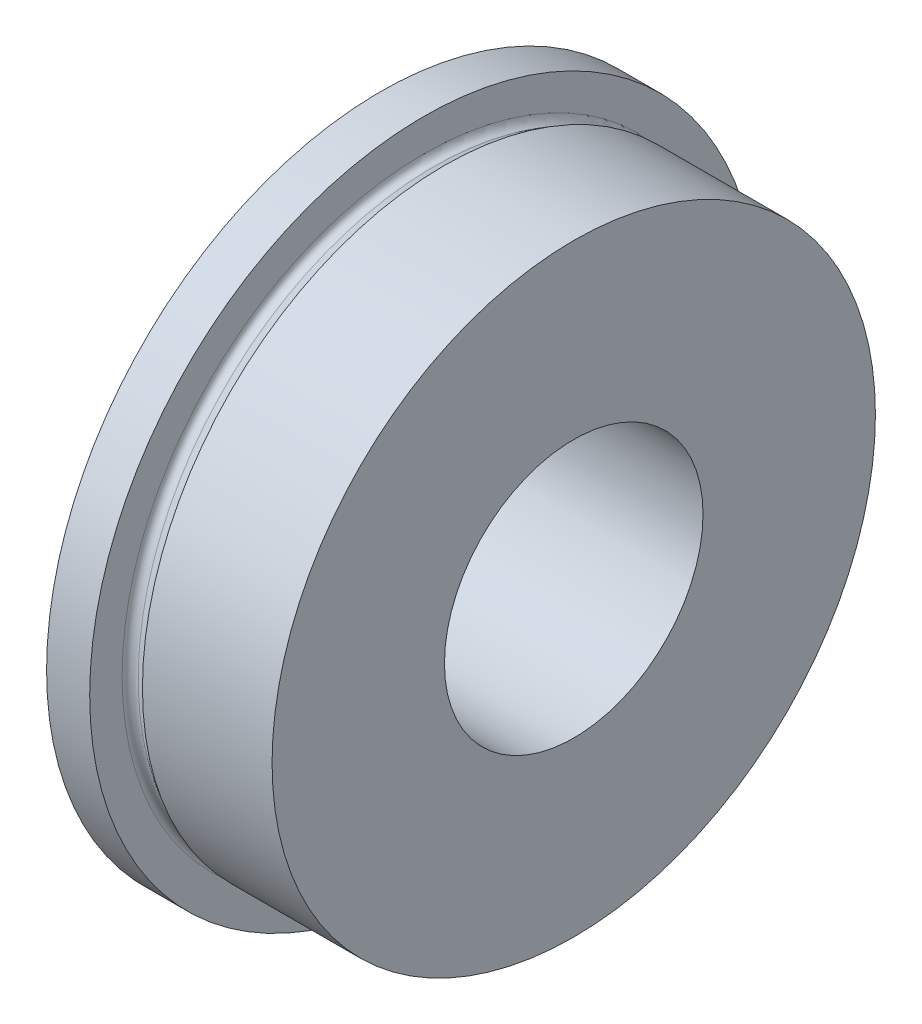
ISO-10303-21;
HEADER;
FILE_DESCRIPTION(('STEP AP214'),'2;1');
FILE_NAME('part.step','',(''),(''),'','','');
FILE_SCHEMA(('AUTOMOTIVE_DESIGN { 1 0 10303 214 1 1 1 1 }'));
ENDSEC;
DATA;
#1=APPLICATION_CONTEXT('core data for automotive mechanical design processes');
#2=APPLICATION_PROTOCOL_DEFINITION('international standard','automotive_design',2000,#1);
#3=PRODUCT_CONTEXT('',#1,'mechanical');
#4=PRODUCT('Part','Part','',(#3));
#5=PRODUCT_RELATED_PRODUCT_CATEGORY('part','',(#4));
#6=PRODUCT_DEFINITION_FORMATION('','',#4);
#7=PRODUCT_DEFINITION_CONTEXT('part definition',#1,'design');
#8=PRODUCT_DEFINITION('design','',#6,#7);
#9=PRODUCT_DEFINITION_SHAPE('','',#8);
#10=(LENGTH_UNIT() NAMED_UNIT(*) SI_UNIT(.MILLI.,.METRE.));
#11=(NAMED_UNIT(*) PLANE_ANGLE_UNIT() SI_UNIT($,.RADIAN.));
#12=(NAMED_UNIT(*) SI_UNIT($,.STERADIAN.) SOLID_ANGLE_UNIT());
#13=UNCERTAINTY_MEASURE_WITH_UNIT(LENGTH_MEASURE(1.E-05),#10,'distance_accuracy_value','');
#14=(GEOMETRIC_REPRESENTATION_CONTEXT(3) GLOBAL_UNCERTAINTY_ASSIGNED_CONTEXT((#13)) GLOBAL_UNIT_ASSIGNED_CONTEXT((#10,
#11,#12)) REPRESENTATION_CONTEXT('',''));
#15=CARTESIAN_POINT('',(0.,0.,0.));
#16=DIRECTION('',(0.,0.,1.));
#17=DIRECTION('',(1.,0.,0.));
#18=AXIS2_PLACEMENT_3D('',#15,#16,#17);
#19=CARTESIAN_POINT('',(0.,0.,0.));
#20=DIRECTION('',(-1.,0.,0.));
#21=DIRECTION('',(0.,0.,1.));
#22=AXIS2_PLACEMENT_3D('',#19,#20,#21);
#23=CYLINDRICAL_SURFACE('',#22,12.3063);
#24=CARTESIAN_POINT('',(0.,0.,0.));
#25=DIRECTION('',(-1.,0.,0.));
#26=DIRECTION('',(0.,0.,1.));
#27=AXIS2_PLACEMENT_3D('',#24,#25,#26);
#28=CIRCLE('',#27,12.3063);
#29=CARTESIAN_POINT('',(0.,0.,12.3063));
#30=VERTEX_POINT('',#29);
#31=EDGE_CURVE('E96',#30,#30,#28,.F.);
#32=ORIENTED_EDGE('',*,*,#31,.T.);
#33=EDGE_LOOP('',(#32));
#34=FACE_BOUND('',#33,.T.);
#35=CARTESIAN_POINT('',(1.5875,0.,0.));
#36=DIRECTION('',(-1.,0.,0.));
#37=DIRECTION('',(0.,0.,1.));
#38=AXIS2_PLACEMENT_3D('',#35,#36,#37);
#39=CIRCLE('',#38,12.3063);
#40=CARTESIAN_POINT('',(1.5875,0.,12.3063));
#41=VERTEX_POINT('',#40);
#42=EDGE_CURVE('E94',#41,#41,#39,.T.);
#43=ORIENTED_EDGE('',*,*,#42,.T.);
#44=EDGE_LOOP('',(#43));
#45=FACE_BOUND('',#44,.T.);
#46=ADVANCED_FACE('F17',(#34,#45),#23,.T.);
#47=CARTESIAN_POINT('',(0.,12.3063,0.));
#48=DIRECTION('',(1.,0.,0.));
#49=DIRECTION('',(0.,0.,-1.));
#50=AXIS2_PLACEMENT_3D('',#47,#48,#49);
#51=PLANE('',#50);
#52=ORIENTED_EDGE('',*,*,#31,.F.);
#53=EDGE_LOOP('',(#52));
#54=FACE_BOUND('',#53,.T.);
#55=CARTESIAN_POINT('',(0.,0.,0.));
#56=DIRECTION('',(-1.,0.,0.));
#57=DIRECTION('',(0.,0.,1.));
#58=AXIS2_PLACEMENT_3D('',#55,#56,#57);
#59=CIRCLE('',#58,9.906);
#60=CARTESIAN_POINT('',(0.,0.,9.906));
#61=VERTEX_POINT('',#60);
#62=EDGE_CURVE('E48',#61,#61,#59,.F.);
#63=ORIENTED_EDGE('',*,*,#62,.T.);
#64=EDGE_LOOP('',(#63));
#65=FACE_BOUND('',#64,.T.);
#66=ADVANCED_FACE('F66',(#54,#65),#51,.F.);
#67=CARTESIAN_POINT('',(1.5875,11.1125,0.));
#68=DIRECTION('',(-1.,0.,0.));
#69=DIRECTION('',(0.,0.,1.));
#70=AXIS2_PLACEMENT_3D('',#67,#68,#69);
#71=PLANE('',#70);
#72=CARTESIAN_POINT('',(1.5875,0.,0.));
#73=DIRECTION('',(1.,0.,0.));
#74=DIRECTION('',(0.,0.,1.));
#75=AXIS2_PLACEMENT_3D('',#72,#73,#74);
#76=CIRCLE('',#75,11.1125);
#77=CARTESIAN_POINT('',(1.5875,0.,-11.1125));
#78=VERTEX_POINT('',#77);
#79=CARTESIAN_POINT('',(1.5875,0.,11.1125));
#80=VERTEX_POINT('',#79);
#81=EDGE_CURVE('E34',#78,#80,#76,.F.);
#82=ORIENTED_EDGE('',*,*,#81,.T.);
#83=CARTESIAN_POINT('',(1.5875,0.,0.));
#84=DIRECTION('',(1.,0.,0.));
#85=DIRECTION('',(0.,0.,-1.));
#86=AXIS2_PLACEMENT_3D('',#83,#84,#85);
#87=CIRCLE('',#86,11.1125);
#88=EDGE_CURVE('E36',#80,#78,#87,.F.);
#89=ORIENTED_EDGE('',*,*,#88,.T.);
#90=EDGE_LOOP('',(#82,#89));
#91=FACE_BOUND('',#90,.T.);
#92=ORIENTED_EDGE('',*,*,#42,.F.);
#93=EDGE_LOOP('',(#92));
#94=FACE_BOUND('',#93,.T.);
#95=ADVANCED_FACE('F46',(#91,#94),#71,.F.);
#96=CARTESIAN_POINT('',(0.,0.,0.));
#97=DIRECTION('',(-1.,0.,0.));
#98=DIRECTION('',(0.,0.,1.));
#99=AXIS2_PLACEMENT_3D('',#96,#97,#98);
#100=CYLINDRICAL_SURFACE('',#99,9.906);
#101=CARTESIAN_POINT('',(0.381,0.,0.));
#102=DIRECTION('',(-1.,0.,0.));
#103=DIRECTION('',(0.,0.,1.));
#104=AXIS2_PLACEMENT_3D('',#101,#102,#103);
#105=CIRCLE('',#104,9.906);
#106=CARTESIAN_POINT('',(0.381,0.,9.906));
#107=VERTEX_POINT('',#106);
#108=EDGE_CURVE('E42',#107,#107,#105,.F.);
#109=ORIENTED_EDGE('',*,*,#108,.T.);
#110=EDGE_LOOP('',(#109));
#111=FACE_BOUND('',#110,.T.);
#112=ORIENTED_EDGE('',*,*,#62,.F.);
#113=EDGE_LOOP('',(#112));
#114=FACE_BOUND('',#113,.T.);
#115=ADVANCED_FACE('F65',(#111,#114),#100,.F.);
#116=CARTESIAN_POINT('',(0.381,9.906,0.));
#117=DIRECTION('',(1.,0.,0.));
#118=DIRECTION('',(0.,0.,-1.));
#119=AXIS2_PLACEMENT_3D('',#116,#117,#118);
#120=PLANE('',#119);
#121=ORIENTED_EDGE('',*,*,#108,.F.);
#122=EDGE_LOOP('',(#121));
#123=FACE_BOUND('',#122,.T.);
#124=CARTESIAN_POINT('',(0.381,0.,0.));
#125=DIRECTION('',(-1.,0.,0.));
#126=DIRECTION('',(0.,0.,1.));
#127=AXIS2_PLACEMENT_3D('',#124,#125,#126);
#128=CIRCLE('',#127,6.35);
#129=CARTESIAN_POINT('',(0.381,0.,6.35));
#130=VERTEX_POINT('',#129);
#131=EDGE_CURVE('E87',#130,#130,#128,.T.);
#132=ORIENTED_EDGE('',*,*,#131,.F.);
#133=EDGE_LOOP('',(#132));
#134=FACE_BOUND('',#133,.T.);
#135=ADVANCED_FACE('F107',(#123,#134),#120,.F.);
#136=CARTESIAN_POINT('',(1.8375,0.,0.));
#137=DIRECTION('',(-1.,0.,0.));
#138=DIRECTION('',(0.,0.,1.));
#139=AXIS2_PLACEMENT_3D('',#136,#137,#138);
#140=TOROIDAL_SURFACE('',#139,11.1125,0.250000000000001);
#141=ORIENTED_EDGE('',*,*,#88,.F.);
#142=ORIENTED_EDGE('',*,*,#81,.F.);
#143=EDGE_LOOP('',(#141,#142));
#144=FACE_BOUND('',#143,.T.);
#145=CARTESIAN_POINT('',(1.9625,0.,0.));
#146=DIRECTION('',(1.,0.,0.));
#147=DIRECTION('',(0.,0.,-1.));
#148=AXIS2_PLACEMENT_3D('',#145,#146,#147);
#149=CIRCLE('',#148,10.8959936490539);
#150=CARTESIAN_POINT('',(1.9625,0.,-10.8959936490539));
#151=VERTEX_POINT('',#150);
#152=EDGE_CURVE('E86',#151,#151,#149,.T.);
#153=ORIENTED_EDGE('',*,*,#152,.F.);
#154=EDGE_LOOP('',(#153));
#155=FACE_BOUND('',#154,.T.);
#156=ADVANCED_FACE('F38',(#144,#155),#140,.F.);
#157=CARTESIAN_POINT('',(0.,0.,0.));
#158=DIRECTION('',(-1.,0.,0.));
#159=DIRECTION('',(0.,0.,1.));
#160=AXIS2_PLACEMENT_3D('',#157,#158,#159);
#161=CYLINDRICAL_SURFACE('',#160,6.35);
#162=CARTESIAN_POINT('',(0.,0.,0.));
#163=DIRECTION('',(-1.,0.,0.));
#164=DIRECTION('',(0.,0.,1.));
#165=AXIS2_PLACEMENT_3D('',#162,#163,#164);
#166=CIRCLE('',#165,6.35);
#167=CARTESIAN_POINT('',(0.,0.,6.35));
#168=VERTEX_POINT('',#167);
#169=EDGE_CURVE('E83',#168,#168,#166,.F.);
#170=ORIENTED_EDGE('',*,*,#169,.T.);
#171=EDGE_LOOP('',(#170));
#172=FACE_BOUND('',#171,.T.);
#173=ORIENTED_EDGE('',*,*,#131,.T.);
#174=EDGE_LOOP('',(#173));
#175=FACE_BOUND('',#174,.T.);
#176=ADVANCED_FACE('F138',(#172,#175),#161,.T.);
#177=CARTESIAN_POINT('',(2.3375,0.,0.));
#178=DIRECTION('',(1.,0.,0.));
#179=DIRECTION('',(0.,0.,-1.));
#180=AXIS2_PLACEMENT_3D('',#177,#178,#179);
#181=CONICAL_SURFACE('',#180,11.1125,0.523598775598302);
#182=CARTESIAN_POINT('',(2.3375,0.,0.));
#183=DIRECTION('',(-1.,0.,0.));
#184=DIRECTION('',(0.,0.,1.));
#185=AXIS2_PLACEMENT_3D('',#182,#183,#184);
#186=CIRCLE('',#185,11.1125);
#187=CARTESIAN_POINT('',(2.3375,0.,11.1125));
#188=VERTEX_POINT('',#187);
#189=EDGE_CURVE('E82',#188,#188,#186,.F.);
#190=ORIENTED_EDGE('',*,*,#189,.F.);
#191=EDGE_LOOP('',(#190));
#192=FACE_BOUND('',#191,.T.);
#193=ORIENTED_EDGE('',*,*,#152,.T.);
#194=EDGE_LOOP('',(#193));
#195=FACE_BOUND('',#194,.T.);
#196=ADVANCED_FACE('F134',(#192,#195),#181,.T.);
#197=CARTESIAN_POINT('',(0.,6.35,0.));
#198=DIRECTION('',(1.,0.,0.));
#199=DIRECTION('',(0.,0.,-1.));
#200=AXIS2_PLACEMENT_3D('',#197,#198,#199);
#201=PLANE('',#200);
#202=ORIENTED_EDGE('',*,*,#169,.F.);
#203=EDGE_LOOP('',(#202));
#204=FACE_BOUND('',#203,.T.);
#205=CARTESIAN_POINT('',(0.,0.,0.));
#206=DIRECTION('',(-1.,0.,0.));
#207=DIRECTION('',(0.,0.,1.));
#208=AXIS2_PLACEMENT_3D('',#205,#206,#207);
#209=CIRCLE('',#208,4.7625);
#210=CARTESIAN_POINT('',(0.,0.,4.7625));
#211=VERTEX_POINT('',#210);
#212=EDGE_CURVE('E79',#211,#211,#209,.F.);
#213=ORIENTED_EDGE('',*,*,#212,.T.);
#214=EDGE_LOOP('',(#213));
#215=FACE_BOUND('',#214,.T.);
#216=ADVANCED_FACE('F130',(#204,#215),#201,.F.);
#217=CARTESIAN_POINT('',(0.,0.,0.));
#218=DIRECTION('',(-1.,0.,0.));
#219=DIRECTION('',(0.,0.,1.));
#220=AXIS2_PLACEMENT_3D('',#217,#218,#219);
#221=CYLINDRICAL_SURFACE('',#220,11.1125);
#222=ORIENTED_EDGE('',*,*,#189,.T.);
#223=EDGE_LOOP('',(#222));
#224=FACE_BOUND('',#223,.T.);
#225=CARTESIAN_POINT('',(7.112,0.,0.));
#226=DIRECTION('',(-1.,0.,0.));
#227=DIRECTION('',(0.,0.,1.));
#228=AXIS2_PLACEMENT_3D('',#225,#226,#227);
#229=CIRCLE('',#228,11.1125);
#230=CARTESIAN_POINT('',(7.112,0.,11.1125));
#231=VERTEX_POINT('',#230);
#232=EDGE_CURVE('E27',#231,#231,#229,.T.);
#233=ORIENTED_EDGE('',*,*,#232,.T.);
#234=EDGE_LOOP('',(#233));
#235=FACE_BOUND('',#234,.T.);
#236=ADVANCED_FACE('F122',(#224,#235),#221,.T.);
#237=CARTESIAN_POINT('',(0.,0.,0.));
#238=DIRECTION('',(-1.,0.,0.));
#239=DIRECTION('',(0.,0.,1.));
#240=AXIS2_PLACEMENT_3D('',#237,#238,#239);
#241=CYLINDRICAL_SURFACE('',#240,4.7625);
#242=CARTESIAN_POINT('',(7.112,0.,0.));
#243=DIRECTION('',(-1.,0.,0.));
#244=DIRECTION('',(0.,0.,1.));
#245=AXIS2_PLACEMENT_3D('',#242,#243,#244);
#246=CIRCLE('',#245,4.7625);
#247=CARTESIAN_POINT('',(7.112,0.,4.7625));
#248=VERTEX_POINT('',#247);
#249=EDGE_CURVE('E11',#248,#248,#246,.F.);
#250=ORIENTED_EDGE('',*,*,#249,.T.);
#251=EDGE_LOOP('',(#250));
#252=FACE_BOUND('',#251,.T.);
#253=ORIENTED_EDGE('',*,*,#212,.F.);
#254=EDGE_LOOP('',(#253));
#255=FACE_BOUND('',#254,.T.);
#256=ADVANCED_FACE('F116',(#252,#255),#241,.F.);
#257=CARTESIAN_POINT('',(7.112,4.7625,0.));
#258=DIRECTION('',(-1.,0.,0.));
#259=DIRECTION('',(0.,0.,1.));
#260=AXIS2_PLACEMENT_3D('',#257,#258,#259);
#261=PLANE('',#260);
#262=ORIENTED_EDGE('',*,*,#249,.F.);
#263=EDGE_LOOP('',(#262));
#264=FACE_BOUND('',#263,.T.);
#265=ORIENTED_EDGE('',*,*,#232,.F.);
#266=EDGE_LOOP('',(#265));
#267=FACE_BOUND('',#266,.T.);
#268=ADVANCED_FACE('F114',(#264,#267),#261,.F.);
#269=CLOSED_SHELL('',(#46,#66,#95,#115,#135,#156,#176,#196,#216,#236,#256,#268));
#270=MANIFOLD_SOLID_BREP('B1',#269);
#271=ADVANCED_BREP_SHAPE_REPRESENTATION('',(#18,#270),#14);
#272=SHAPE_DEFINITION_REPRESENTATION(#9,#271);
ENDSEC;
END-ISO-10303-21;
